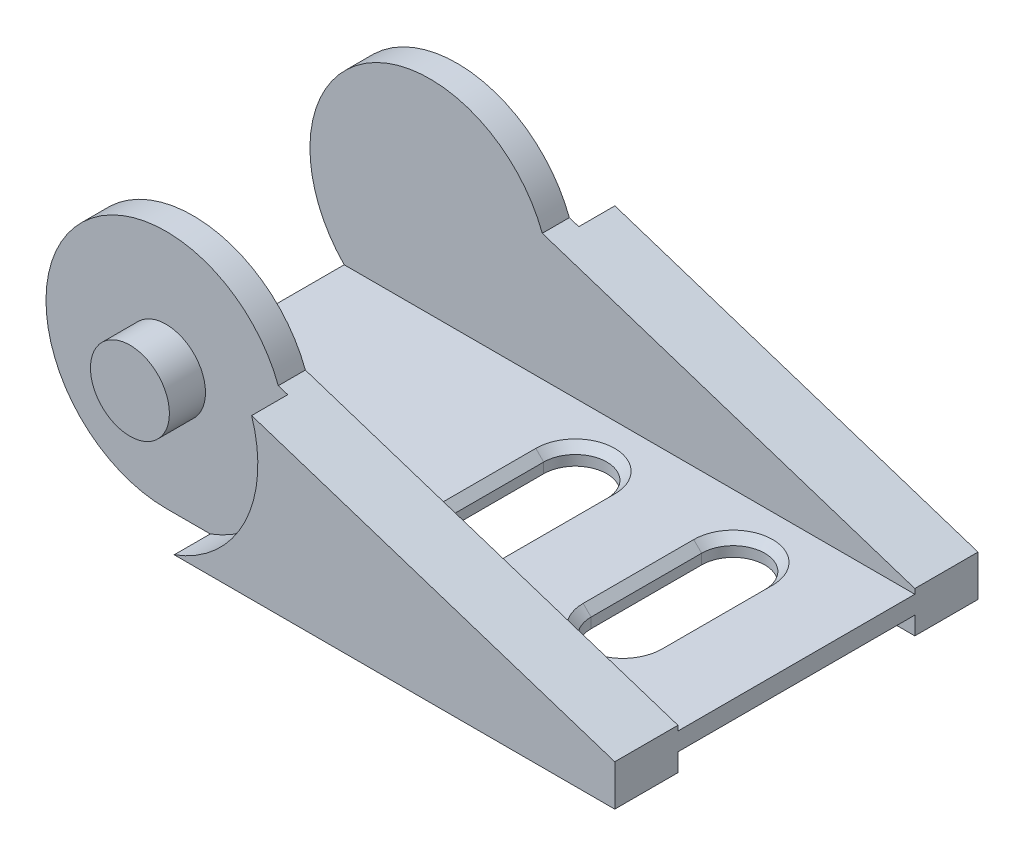
ISO-10303-21;
HEADER;
FILE_DESCRIPTION(('STEP AP214'),'2;1');
FILE_NAME('part.step','',(''),(''),'','','');
FILE_SCHEMA(('AUTOMOTIVE_DESIGN { 1 0 10303 214 1 1 1 1 }'));
ENDSEC;
DATA;
#1=APPLICATION_CONTEXT('core data for automotive mechanical design processes');
#2=APPLICATION_PROTOCOL_DEFINITION('international standard','automotive_design',2000,#1);
#3=PRODUCT_CONTEXT('',#1,'mechanical');
#4=PRODUCT('Part','Part','',(#3));
#5=PRODUCT_RELATED_PRODUCT_CATEGORY('part','',(#4));
#6=PRODUCT_DEFINITION_FORMATION('','',#4);
#7=PRODUCT_DEFINITION_CONTEXT('part definition',#1,'design');
#8=PRODUCT_DEFINITION('design','',#6,#7);
#9=PRODUCT_DEFINITION_SHAPE('','',#8);
#10=(LENGTH_UNIT() NAMED_UNIT(*) SI_UNIT(.MILLI.,.METRE.));
#11=(NAMED_UNIT(*) PLANE_ANGLE_UNIT() SI_UNIT($,.RADIAN.));
#12=(NAMED_UNIT(*) SI_UNIT($,.STERADIAN.) SOLID_ANGLE_UNIT());
#13=UNCERTAINTY_MEASURE_WITH_UNIT(LENGTH_MEASURE(1.E-05),#10,'distance_accuracy_value','');
#14=(GEOMETRIC_REPRESENTATION_CONTEXT(3) GLOBAL_UNCERTAINTY_ASSIGNED_CONTEXT((#13)) GLOBAL_UNIT_ASSIGNED_CONTEXT((#10,
#11,#12)) REPRESENTATION_CONTEXT('',''));
#15=CARTESIAN_POINT('',(0.,0.,0.));
#16=DIRECTION('',(0.,0.,1.));
#17=DIRECTION('',(1.,0.,0.));
#18=AXIS2_PLACEMENT_3D('',#15,#16,#17);
#19=CARTESIAN_POINT('',(-15.35,0.,-23.));
#20=DIRECTION('',(0.,0.,1.));
#21=DIRECTION('',(1.,0.,0.));
#22=AXIS2_PLACEMENT_3D('',#19,#20,#21);
#23=CYLINDRICAL_SURFACE('',#22,7.6);
#24=DIRECTION('',(0.,0.,1.));
#25=VECTOR('',#24,1.);
#26=CARTESIAN_POINT('',(-8.23969257201049,2.68393894853762,-23.));
#27=LINE('',#26,#25);
#28=CARTESIAN_POINT('',(-8.23969257201049,2.68393894853762,-20.7142857142857));
#29=VERTEX_POINT('',#28);
#30=CARTESIAN_POINT('',(-8.23969257201049,2.68393894853762,-19.));
#31=VERTEX_POINT('',#30);
#32=EDGE_CURVE('E267',#29,#31,#27,.T.);
#33=ORIENTED_EDGE('',*,*,#32,.F.);
#34=CARTESIAN_POINT('',(-15.35,0.,-20.7142857142857));
#35=DIRECTION('',(0.,0.,-1.));
#36=DIRECTION('',(-1.,0.,0.));
#37=AXIS2_PLACEMENT_3D('',#34,#35,#36);
#38=CIRCLE('',#37,7.6);
#39=CARTESIAN_POINT('',(-15.35,-7.6,-20.7142857142857));
#40=VERTEX_POINT('',#39);
#41=EDGE_CURVE('E424',#29,#40,#38,.F.);
#42=ORIENTED_EDGE('',*,*,#41,.T.);
#43=DIRECTION('',(0.,0.,1.));
#44=VECTOR('',#43,1.);
#45=CARTESIAN_POINT('',(-15.35,-7.6,-23.));
#46=LINE('',#45,#44);
#47=CARTESIAN_POINT('',(-15.35,-7.60000000000001,-19.));
#48=VERTEX_POINT('',#47);
#49=EDGE_CURVE('E277',#40,#48,#46,.T.);
#50=ORIENTED_EDGE('',*,*,#49,.T.);
#51=CARTESIAN_POINT('',(-15.35,0.,-19.));
#52=DIRECTION('',(0.,0.,-1.));
#53=DIRECTION('',(-1.,0.,0.));
#54=AXIS2_PLACEMENT_3D('',#51,#52,#53);
#55=CIRCLE('',#54,7.6);
#56=CARTESIAN_POINT('',(-19.3581549524,-6.45714285714288,-19.));
#57=VERTEX_POINT('',#56);
#58=EDGE_CURVE('E470',#57,#48,#55,.F.);
#59=ORIENTED_EDGE('',*,*,#58,.F.);
#60=DIRECTION('',(0.,0.,1.));
#61=VECTOR('',#60,1.);
#62=CARTESIAN_POINT('',(-19.3581549524,-6.45714285714288,-23.));
#63=LINE('',#62,#61);
#64=CARTESIAN_POINT('',(-19.3581549524,-6.45714285714288,-4.));
#65=VERTEX_POINT('',#64);
#66=EDGE_CURVE('E468',#65,#57,#63,.F.);
#67=ORIENTED_EDGE('',*,*,#66,.F.);
#68=CARTESIAN_POINT('',(-15.35,0.,-4.));
#69=DIRECTION('',(0.,0.,1.));
#70=DIRECTION('',(1.,0.,0.));
#71=AXIS2_PLACEMENT_3D('',#68,#69,#70);
#72=CIRCLE('',#71,7.6);
#73=CARTESIAN_POINT('',(-15.35,-7.60000000000001,-4.));
#74=VERTEX_POINT('',#73);
#75=EDGE_CURVE('E472',#74,#65,#72,.F.);
#76=ORIENTED_EDGE('',*,*,#75,.F.);
#77=CARTESIAN_POINT('',(-15.35,-7.6,-2.28571428571429));
#78=VERTEX_POINT('',#77);
#79=EDGE_CURVE('E270',#74,#78,#46,.T.);
#80=ORIENTED_EDGE('',*,*,#79,.T.);
#81=CARTESIAN_POINT('',(-15.35,0.,-2.28571428571429));
#82=DIRECTION('',(0.,0.,1.));
#83=DIRECTION('',(1.,0.,0.));
#84=AXIS2_PLACEMENT_3D('',#81,#82,#83);
#85=CIRCLE('',#84,7.6);
#86=CARTESIAN_POINT('',(-8.23969257201049,2.68393894853762,-2.28571428571429));
#87=VERTEX_POINT('',#86);
#88=EDGE_CURVE('E288',#78,#87,#85,.F.);
#89=ORIENTED_EDGE('',*,*,#88,.T.);
#90=CARTESIAN_POINT('',(-8.23969257201049,2.68393894853762,-4.));
#91=VERTEX_POINT('',#90);
#92=EDGE_CURVE('E254',#91,#87,#27,.T.);
#93=ORIENTED_EDGE('',*,*,#92,.F.);
#94=CARTESIAN_POINT('',(-15.35,0.,-4.));
#95=DIRECTION('',(0.,0.,1.));
#96=DIRECTION('',(0.,-1.,0.));
#97=AXIS2_PLACEMENT_3D('',#94,#95,#96);
#98=CIRCLE('',#97,7.6);
#99=CARTESIAN_POINT('',(-20.7830808338307,-5.31428571428573,-4.));
#100=VERTEX_POINT('',#99);
#101=EDGE_CURVE('E393',#100,#91,#98,.F.);
#102=ORIENTED_EDGE('',*,*,#101,.F.);
#103=DIRECTION('',(0.,0.,1.));
#104=VECTOR('',#103,1.);
#105=CARTESIAN_POINT('',(-20.7830808338307,-5.31428571428573,-23.));
#106=LINE('',#105,#104);
#107=CARTESIAN_POINT('',(-20.7830808338307,-5.31428571428573,-19.));
#108=VERTEX_POINT('',#107);
#109=EDGE_CURVE('E260',#108,#100,#106,.T.);
#110=ORIENTED_EDGE('',*,*,#109,.F.);
#111=CARTESIAN_POINT('',(-15.35,0.,-19.));
#112=DIRECTION('',(0.,0.,-1.));
#113=DIRECTION('',(0.,1.,0.));
#114=AXIS2_PLACEMENT_3D('',#111,#112,#113);
#115=CIRCLE('',#114,7.6);
#116=EDGE_CURVE('E391',#31,#108,#115,.F.);
#117=ORIENTED_EDGE('',*,*,#116,.F.);
#118=EDGE_LOOP('',(#33,#42,#50,#59,#67,#76,#80,#89,#93,#102,#110,#117));
#119=FACE_BOUND('',#118,.T.);
#120=ADVANCED_FACE('F36',(#119),#23,.T.);
#121=CARTESIAN_POINT('',(-15.35,-7.6,-23.));
#122=DIRECTION('',(0.,-1.,0.));
#123=DIRECTION('',(1.,0.,0.));
#124=AXIS2_PLACEMENT_3D('',#121,#122,#123);
#125=PLANE('',#124);
#126=DIRECTION('',(1.,0.,0.));
#127=VECTOR('',#126,1.);
#128=CARTESIAN_POINT('',(-15.35,-7.6,-20.7142857142857));
#129=LINE('',#128,#127);
#130=CARTESIAN_POINT('',(-12.5482148547756,-7.6,-20.7142857142857));
#131=VERTEX_POINT('',#130);
#132=EDGE_CURVE('E429',#40,#131,#129,.T.);
#133=ORIENTED_EDGE('',*,*,#132,.T.);
#134=DIRECTION('',(0.,0.,-1.));
#135=VECTOR('',#134,1.);
#136=CARTESIAN_POINT('',(-12.5482148547756,-7.6,-20.7142857142857));
#137=LINE('',#136,#135);
#138=CARTESIAN_POINT('',(-12.5482148547756,-7.6,-23.));
#139=VERTEX_POINT('',#138);
#140=EDGE_CURVE('E875',#131,#139,#137,.T.);
#141=ORIENTED_EDGE('',*,*,#140,.T.);
#142=DIRECTION('',(1.,0.,0.));
#143=VECTOR('',#142,1.);
#144=CARTESIAN_POINT('',(-15.35,-7.6,-23.));
#145=LINE('',#144,#143);
#146=CARTESIAN_POINT('',(15.35,-7.59999999999999,-23.));
#147=VERTEX_POINT('',#146);
#148=EDGE_CURVE('E243',#139,#147,#145,.T.);
#149=ORIENTED_EDGE('',*,*,#148,.T.);
#150=DIRECTION('',(0.,0.,1.));
#151=VECTOR('',#150,1.);
#152=CARTESIAN_POINT('',(15.35,-7.59999999999999,-23.));
#153=LINE('',#152,#151);
#154=CARTESIAN_POINT('',(15.35,-7.59999999999999,-19.));
#155=VERTEX_POINT('',#154);
#156=EDGE_CURVE('E272',#147,#155,#153,.T.);
#157=ORIENTED_EDGE('',*,*,#156,.T.);
#158=DIRECTION('',(1.,0.,0.));
#159=VECTOR('',#158,1.);
#160=CARTESIAN_POINT('',(-22.95,-7.60000000000002,-19.));
#161=LINE('',#160,#159);
#162=EDGE_CURVE('E435',#48,#155,#161,.T.);
#163=ORIENTED_EDGE('',*,*,#162,.F.);
#164=ORIENTED_EDGE('',*,*,#49,.F.);
#165=EDGE_LOOP('',(#133,#141,#149,#157,#163,#164));
#166=FACE_BOUND('',#165,.T.);
#167=ADVANCED_FACE('F434',(#166),#125,.T.);
#168=CARTESIAN_POINT('',(-8.23969257201049,2.68393894853762,-23.));
#169=DIRECTION('',(-0.309716291994659,-0.950829016423604,0.));
#170=DIRECTION('',(0.950829016423605,-0.309716291994659,0.));
#171=AXIS2_PLACEMENT_3D('',#168,#169,#170);
#172=PLANE('',#171);
#173=DIRECTION('',(0.,0.,-1.));
#174=VECTOR('',#173,1.);
#175=CARTESIAN_POINT('',(-7.6419734396417,2.48924216274974,-20.7142857142857));
#176=LINE('',#175,#174);
#177=CARTESIAN_POINT('',(-7.6419734396417,2.48924216274974,-20.7142857142857));
#178=VERTEX_POINT('',#177);
#179=CARTESIAN_POINT('',(-7.6419734396417,2.48924216274974,-23.));
#180=VERTEX_POINT('',#179);
#181=EDGE_CURVE('E224',#178,#180,#176,.T.);
#182=ORIENTED_EDGE('',*,*,#181,.F.);
#183=DIRECTION('',(0.950829016423605,-0.309716291994659,0.));
#184=VECTOR('',#183,1.);
#185=CARTESIAN_POINT('',(-8.23969257201049,2.68393894853762,-20.7142857142857));
#186=LINE('',#185,#184);
#187=EDGE_CURVE('E235',#29,#178,#186,.T.);
#188=ORIENTED_EDGE('',*,*,#187,.F.);
#189=ORIENTED_EDGE('',*,*,#32,.T.);
#190=DIRECTION('',(0.950829016423605,-0.309716291994659,0.));
#191=VECTOR('',#190,1.);
#192=CARTESIAN_POINT('',(-8.23969257201049,2.68393894853762,-19.));
#193=LINE('',#192,#191);
#194=CARTESIAN_POINT('',(15.35,-5.,-19.));
#195=VERTEX_POINT('',#194);
#196=EDGE_CURVE('E275',#31,#195,#193,.T.);
#197=ORIENTED_EDGE('',*,*,#196,.T.);
#198=DIRECTION('',(0.,0.,1.));
#199=VECTOR('',#198,1.);
#200=CARTESIAN_POINT('',(15.35,-5.,-23.));
#201=LINE('',#200,#199);
#202=CARTESIAN_POINT('',(15.35,-5.,-23.));
#203=VERTEX_POINT('',#202);
#204=EDGE_CURVE('E249',#203,#195,#201,.T.);
#205=ORIENTED_EDGE('',*,*,#204,.F.);
#206=DIRECTION('',(0.950829016423604,-0.309716291994659,0.));
#207=VECTOR('',#206,1.);
#208=CARTESIAN_POINT('',(-8.23969257201049,2.68393894853762,-23.));
#209=LINE('',#208,#207);
#210=EDGE_CURVE('E241',#180,#203,#209,.T.);
#211=ORIENTED_EDGE('',*,*,#210,.F.);
#212=EDGE_LOOP('',(#182,#188,#189,#197,#205,#211));
#213=FACE_BOUND('',#212,.T.);
#214=ADVANCED_FACE('F246',(#213),#172,.F.);
#215=DIRECTION('',(0.,0.,1.));
#216=VECTOR('',#215,1.);
#217=CARTESIAN_POINT('',(-12.5482148547756,-7.6,-2.28571428571429));
#218=LINE('',#217,#216);
#219=CARTESIAN_POINT('',(-12.5482148547756,-7.6,-2.28571428571429));
#220=VERTEX_POINT('',#219);
#221=CARTESIAN_POINT('',(-12.5482148547756,-7.6,0.));
#222=VERTEX_POINT('',#221);
#223=EDGE_CURVE('E840',#220,#222,#218,.T.);
#224=ORIENTED_EDGE('',*,*,#223,.F.);
#225=DIRECTION('',(-1.,0.,0.));
#226=VECTOR('',#225,1.);
#227=CARTESIAN_POINT('',(-15.35,-7.6,-2.28571428571429));
#228=LINE('',#227,#226);
#229=EDGE_CURVE('E842',#220,#78,#228,.T.);
#230=ORIENTED_EDGE('',*,*,#229,.T.);
#231=ORIENTED_EDGE('',*,*,#79,.F.);
#232=DIRECTION('',(1.,0.,0.));
#233=VECTOR('',#232,1.);
#234=CARTESIAN_POINT('',(-22.95,-7.60000000000002,-4.));
#235=LINE('',#234,#233);
#236=CARTESIAN_POINT('',(15.35,-7.59999999999999,-4.));
#237=VERTEX_POINT('',#236);
#238=EDGE_CURVE('E441',#74,#237,#235,.T.);
#239=ORIENTED_EDGE('',*,*,#238,.T.);
#240=CARTESIAN_POINT('',(15.35,-7.59999999999999,0.));
#241=VERTEX_POINT('',#240);
#242=EDGE_CURVE('E276',#237,#241,#153,.T.);
#243=ORIENTED_EDGE('',*,*,#242,.T.);
#244=DIRECTION('',(1.,0.,0.));
#245=VECTOR('',#244,1.);
#246=CARTESIAN_POINT('',(-15.35,-7.6,0.));
#247=LINE('',#246,#245);
#248=EDGE_CURVE('E265',#222,#241,#247,.T.);
#249=ORIENTED_EDGE('',*,*,#248,.F.);
#250=EDGE_LOOP('',(#224,#230,#231,#239,#243,#249));
#251=FACE_BOUND('',#250,.T.);
#252=ADVANCED_FACE('F533',(#251),#125,.T.);
#253=DIRECTION('',(-0.950829016423605,0.309716291994659,0.));
#254=VECTOR('',#253,1.);
#255=CARTESIAN_POINT('',(-8.23969257201049,2.68393894853762,-2.28571428571429));
#256=LINE('',#255,#254);
#257=CARTESIAN_POINT('',(-7.6419734396417,2.48924216274974,-2.28571428571429));
#258=VERTEX_POINT('',#257);
#259=EDGE_CURVE('E412',#258,#87,#256,.T.);
#260=ORIENTED_EDGE('',*,*,#259,.F.);
#261=DIRECTION('',(0.,0.,1.));
#262=VECTOR('',#261,1.);
#263=CARTESIAN_POINT('',(-7.6419734396417,2.48924216274974,-2.28571428571429));
#264=LINE('',#263,#262);
#265=CARTESIAN_POINT('',(-7.6419734396417,2.48924216274974,0.));
#266=VERTEX_POINT('',#265);
#267=EDGE_CURVE('E846',#258,#266,#264,.T.);
#268=ORIENTED_EDGE('',*,*,#267,.T.);
#269=DIRECTION('',(0.950829016423604,-0.309716291994659,0.));
#270=VECTOR('',#269,1.);
#271=CARTESIAN_POINT('',(-8.23969257201049,2.68393894853762,0.));
#272=LINE('',#271,#270);
#273=CARTESIAN_POINT('',(15.35,-5.,0.));
#274=VERTEX_POINT('',#273);
#275=EDGE_CURVE('E257',#266,#274,#272,.T.);
#276=ORIENTED_EDGE('',*,*,#275,.T.);
#277=CARTESIAN_POINT('',(15.35,-4.99999999999999,-4.));
#278=VERTEX_POINT('',#277);
#279=EDGE_CURVE('E266',#278,#274,#201,.T.);
#280=ORIENTED_EDGE('',*,*,#279,.F.);
#281=DIRECTION('',(-0.950829016423605,0.309716291994659,0.));
#282=VECTOR('',#281,1.);
#283=CARTESIAN_POINT('',(-8.23969257201049,2.68393894853762,-4.));
#284=LINE('',#283,#282);
#285=EDGE_CURVE('E280',#278,#91,#284,.T.);
#286=ORIENTED_EDGE('',*,*,#285,.T.);
#287=ORIENTED_EDGE('',*,*,#92,.T.);
#288=EDGE_LOOP('',(#260,#268,#276,#280,#286,#287));
#289=FACE_BOUND('',#288,.T.);
#290=ADVANCED_FACE('F410',(#289),#172,.F.);
#291=CARTESIAN_POINT('',(-15.35,0.,-23.));
#292=DIRECTION('',(0.,0.,1.));
#293=DIRECTION('',(1.,0.,0.));
#294=AXIS2_PLACEMENT_3D('',#291,#292,#293);
#295=PLANE('',#294);
#296=CARTESIAN_POINT('',(-15.35,0.,-23.));
#297=DIRECTION('',(0.,0.,1.));
#298=DIRECTION('',(1.,0.,0.));
#299=AXIS2_PLACEMENT_3D('',#296,#297,#298);
#300=CIRCLE('',#299,8.1);
#301=EDGE_CURVE('E227',#139,#180,#300,.T.);
#302=ORIENTED_EDGE('',*,*,#301,.T.);
#303=ORIENTED_EDGE('',*,*,#210,.T.);
#304=DIRECTION('',(0.,-1.,0.));
#305=VECTOR('',#304,1.);
#306=CARTESIAN_POINT('',(15.35,-5.,-23.));
#307=LINE('',#306,#305);
#308=EDGE_CURVE('E251',#203,#147,#307,.T.);
#309=ORIENTED_EDGE('',*,*,#308,.T.);
#310=ORIENTED_EDGE('',*,*,#148,.F.);
#311=EDGE_LOOP('',(#302,#303,#309,#310));
#312=FACE_BOUND('',#311,.T.);
#313=ADVANCED_FACE('F239',(#312),#295,.F.);
#314=CARTESIAN_POINT('',(-15.35,0.,0.));
#315=DIRECTION('',(0.,0.,1.));
#316=DIRECTION('',(1.,0.,0.));
#317=AXIS2_PLACEMENT_3D('',#314,#315,#316);
#318=PLANE('',#317);
#319=CARTESIAN_POINT('',(-15.35,0.,0.));
#320=DIRECTION('',(0.,0.,1.));
#321=DIRECTION('',(1.,0.,0.));
#322=AXIS2_PLACEMENT_3D('',#319,#320,#321);
#323=CIRCLE('',#322,8.1);
#324=EDGE_CURVE('E286',#222,#266,#323,.T.);
#325=ORIENTED_EDGE('',*,*,#324,.F.);
#326=ORIENTED_EDGE('',*,*,#248,.T.);
#327=DIRECTION('',(0.,-1.,0.));
#328=VECTOR('',#327,1.);
#329=CARTESIAN_POINT('',(15.35,-5.,0.));
#330=LINE('',#329,#328);
#331=EDGE_CURVE('E252',#274,#241,#330,.T.);
#332=ORIENTED_EDGE('',*,*,#331,.F.);
#333=ORIENTED_EDGE('',*,*,#275,.F.);
#334=EDGE_LOOP('',(#325,#326,#332,#333));
#335=FACE_BOUND('',#334,.T.);
#336=ADVANCED_FACE('F736',(#335),#318,.T.);
#337=CARTESIAN_POINT('',(15.35,-5.,-23.));
#338=DIRECTION('',(-1.,0.,0.));
#339=DIRECTION('',(0.,-1.,0.));
#340=AXIS2_PLACEMENT_3D('',#337,#338,#339);
#341=PLANE('',#340);
#342=ORIENTED_EDGE('',*,*,#242,.F.);
#343=DIRECTION('',(0.,-1.,0.));
#344=VECTOR('',#343,1.);
#345=CARTESIAN_POINT('',(15.35,-6.45714285714285,-4.));
#346=LINE('',#345,#344);
#347=CARTESIAN_POINT('',(15.35,-6.45714285714285,-4.));
#348=VERTEX_POINT('',#347);
#349=EDGE_CURVE('E854',#348,#237,#346,.T.);
#350=ORIENTED_EDGE('',*,*,#349,.F.);
#351=DIRECTION('',(0.,0.,1.));
#352=VECTOR('',#351,1.);
#353=CARTESIAN_POINT('',(15.35,-6.45714285714285,-4.));
#354=LINE('',#353,#352);
#355=CARTESIAN_POINT('',(15.35,-6.45714285714285,-19.));
#356=VERTEX_POINT('',#355);
#357=EDGE_CURVE('E446',#356,#348,#354,.T.);
#358=ORIENTED_EDGE('',*,*,#357,.F.);
#359=DIRECTION('',(0.,1.,0.));
#360=VECTOR('',#359,1.);
#361=CARTESIAN_POINT('',(15.35,-6.45714285714285,-19.));
#362=LINE('',#361,#360);
#363=EDGE_CURVE('E856',#155,#356,#362,.T.);
#364=ORIENTED_EDGE('',*,*,#363,.F.);
#365=ORIENTED_EDGE('',*,*,#156,.F.);
#366=ORIENTED_EDGE('',*,*,#308,.F.);
#367=ORIENTED_EDGE('',*,*,#204,.T.);
#368=DIRECTION('',(0.,1.,0.));
#369=VECTOR('',#368,1.);
#370=CARTESIAN_POINT('',(15.35,7.60000000000002,-19.));
#371=LINE('',#370,#369);
#372=CARTESIAN_POINT('',(15.35,-5.3142857142857,-19.));
#373=VERTEX_POINT('',#372);
#374=EDGE_CURVE('E386',#373,#195,#371,.T.);
#375=ORIENTED_EDGE('',*,*,#374,.F.);
#376=DIRECTION('',(0.,0.,-1.));
#377=VECTOR('',#376,1.);
#378=CARTESIAN_POINT('',(15.35,-5.31428571428571,-4.));
#379=LINE('',#378,#377);
#380=CARTESIAN_POINT('',(15.35,-5.31428571428571,-4.));
#381=VERTEX_POINT('',#380);
#382=EDGE_CURVE('E383',#381,#373,#379,.T.);
#383=ORIENTED_EDGE('',*,*,#382,.F.);
#384=DIRECTION('',(0.,-1.,0.));
#385=VECTOR('',#384,1.);
#386=CARTESIAN_POINT('',(15.35,7.60000000000002,-4.));
#387=LINE('',#386,#385);
#388=EDGE_CURVE('E373',#278,#381,#387,.T.);
#389=ORIENTED_EDGE('',*,*,#388,.F.);
#390=ORIENTED_EDGE('',*,*,#279,.T.);
#391=ORIENTED_EDGE('',*,*,#331,.T.);
#392=EDGE_LOOP('',(#342,#350,#358,#364,#365,#366,#367,#375,#383,#389,#390,#391));
#393=FACE_BOUND('',#392,.T.);
#394=ADVANCED_FACE('F417',(#393),#341,.F.);
#395=CARTESIAN_POINT('',(-22.95,7.59999999999999,-4.));
#396=DIRECTION('',(0.,0.,1.));
#397=DIRECTION('',(0.,-1.,0.));
#398=AXIS2_PLACEMENT_3D('',#395,#396,#397);
#399=PLANE('',#398);
#400=ORIENTED_EDGE('',*,*,#101,.T.);
#401=ORIENTED_EDGE('',*,*,#285,.F.);
#402=ORIENTED_EDGE('',*,*,#388,.T.);
#403=DIRECTION('',(1.,0.,0.));
#404=VECTOR('',#403,1.);
#405=CARTESIAN_POINT('',(-22.95,-5.31428571428573,-4.));
#406=LINE('',#405,#404);
#407=EDGE_CURVE('E388',#100,#381,#406,.T.);
#408=ORIENTED_EDGE('',*,*,#407,.F.);
#409=EDGE_LOOP('',(#400,#401,#402,#408));
#410=FACE_BOUND('',#409,.T.);
#411=ADVANCED_FACE('F401',(#410),#399,.F.);
#412=CARTESIAN_POINT('',(-22.95,7.59999999999999,-19.));
#413=DIRECTION('',(0.,0.,-1.));
#414=DIRECTION('',(0.,1.,0.));
#415=AXIS2_PLACEMENT_3D('',#412,#413,#414);
#416=PLANE('',#415);
#417=ORIENTED_EDGE('',*,*,#116,.T.);
#418=DIRECTION('',(1.,0.,0.));
#419=VECTOR('',#418,1.);
#420=CARTESIAN_POINT('',(-22.95,-5.31428571428573,-19.));
#421=LINE('',#420,#419);
#422=EDGE_CURVE('E389',#108,#373,#421,.T.);
#423=ORIENTED_EDGE('',*,*,#422,.T.);
#424=ORIENTED_EDGE('',*,*,#374,.T.);
#425=ORIENTED_EDGE('',*,*,#196,.F.);
#426=EDGE_LOOP('',(#417,#423,#424,#425));
#427=FACE_BOUND('',#426,.T.);
#428=ADVANCED_FACE('F422',(#427),#416,.F.);
#429=CARTESIAN_POINT('',(-22.95,-5.31428571428573,-4.));
#430=DIRECTION('',(0.,-1.,0.));
#431=DIRECTION('',(1.,0.,0.));
#432=AXIS2_PLACEMENT_3D('',#429,#430,#431);
#433=PLANE('',#432);
#434=DIRECTION('',(0.,0.,1.));
#435=VECTOR('',#434,1.);
#436=CARTESIAN_POINT('',(0.350000000000007,-5.31428571428572,-4.));
#437=LINE('',#436,#435);
#438=CARTESIAN_POINT('',(0.350000000000006,-5.31428571428571,-15.));
#439=VERTEX_POINT('',#438);
#440=CARTESIAN_POINT('',(0.350000000000006,-5.31428571428572,-8.));
#441=VERTEX_POINT('',#440);
#442=EDGE_CURVE('E307',#439,#441,#437,.T.);
#443=ORIENTED_EDGE('',*,*,#442,.T.);
#444=CARTESIAN_POINT('',(-2.15,-5.31428571428572,-8.));
#445=DIRECTION('',(0.,-1.,0.));
#446=DIRECTION('',(1.,0.,0.));
#447=AXIS2_PLACEMENT_3D('',#444,#445,#446);
#448=CIRCLE('',#447,2.50000000000001);
#449=CARTESIAN_POINT('',(-4.65000000000001,-5.31428571428572,-8.));
#450=VERTEX_POINT('',#449);
#451=EDGE_CURVE('E309',#441,#450,#448,.T.);
#452=ORIENTED_EDGE('',*,*,#451,.T.);
#453=DIRECTION('',(0.,0.,-1.));
#454=VECTOR('',#453,1.);
#455=CARTESIAN_POINT('',(-4.65000000000001,-5.31428571428572,-4.));
#456=LINE('',#455,#454);
#457=CARTESIAN_POINT('',(-4.65000000000001,-5.31428571428572,-15.));
#458=VERTEX_POINT('',#457);
#459=EDGE_CURVE('E305',#450,#458,#456,.T.);
#460=ORIENTED_EDGE('',*,*,#459,.T.);
#461=CARTESIAN_POINT('',(-2.15,-5.31428571428572,-15.));
#462=DIRECTION('',(0.,-1.,0.));
#463=DIRECTION('',(1.,0.,0.));
#464=AXIS2_PLACEMENT_3D('',#461,#462,#463);
#465=CIRCLE('',#464,2.50000000000001);
#466=EDGE_CURVE('E303',#458,#439,#465,.T.);
#467=ORIENTED_EDGE('',*,*,#466,.T.);
#468=EDGE_LOOP('',(#443,#452,#460,#467));
#469=FACE_BOUND('',#468,.T.);
#470=DIRECTION('',(0.,0.,1.));
#471=VECTOR('',#470,1.);
#472=CARTESIAN_POINT('',(10.35,-5.31428571428571,-4.));
#473=LINE('',#472,#471);
#474=CARTESIAN_POINT('',(10.35,-5.31428571428571,-15.));
#475=VERTEX_POINT('',#474);
#476=CARTESIAN_POINT('',(10.35,-5.31428571428571,-8.));
#477=VERTEX_POINT('',#476);
#478=EDGE_CURVE('E298',#475,#477,#473,.T.);
#479=ORIENTED_EDGE('',*,*,#478,.T.);
#480=CARTESIAN_POINT('',(7.85,-5.31428571428571,-8.));
#481=DIRECTION('',(0.,-1.,0.));
#482=DIRECTION('',(1.,0.,0.));
#483=AXIS2_PLACEMENT_3D('',#480,#481,#482);
#484=CIRCLE('',#483,2.49999999999999);
#485=CARTESIAN_POINT('',(5.35,-5.31428571428571,-8.));
#486=VERTEX_POINT('',#485);
#487=EDGE_CURVE('E300',#477,#486,#484,.T.);
#488=ORIENTED_EDGE('',*,*,#487,.T.);
#489=DIRECTION('',(0.,0.,-1.));
#490=VECTOR('',#489,1.);
#491=CARTESIAN_POINT('',(5.35,-5.31428571428571,-4.));
#492=LINE('',#491,#490);
#493=CARTESIAN_POINT('',(5.35,-5.31428571428571,-15.));
#494=VERTEX_POINT('',#493);
#495=EDGE_CURVE('E294',#486,#494,#492,.T.);
#496=ORIENTED_EDGE('',*,*,#495,.T.);
#497=CARTESIAN_POINT('',(7.85,-5.31428571428571,-15.));
#498=DIRECTION('',(0.,-1.,0.));
#499=DIRECTION('',(1.,0.,0.));
#500=AXIS2_PLACEMENT_3D('',#497,#498,#499);
#501=CIRCLE('',#500,2.5);
#502=EDGE_CURVE('E296',#494,#475,#501,.T.);
#503=ORIENTED_EDGE('',*,*,#502,.T.);
#504=EDGE_LOOP('',(#479,#488,#496,#503));
#505=FACE_BOUND('',#504,.T.);
#506=ORIENTED_EDGE('',*,*,#109,.T.);
#507=ORIENTED_EDGE('',*,*,#407,.T.);
#508=ORIENTED_EDGE('',*,*,#382,.T.);
#509=ORIENTED_EDGE('',*,*,#422,.F.);
#510=EDGE_LOOP('',(#506,#507,#508,#509));
#511=FACE_BOUND('',#510,.T.);
#512=ADVANCED_FACE('F352',(#469,#505,#511),#433,.F.);
#513=CARTESIAN_POINT('',(7.85,-7.6,-15.));
#514=DIRECTION('',(0.,1.,0.));
#515=DIRECTION('',(-1.,0.,0.));
#516=AXIS2_PLACEMENT_3D('',#513,#514,#515);
#517=CYLINDRICAL_SURFACE('',#516,2.);
#518=DIRECTION('',(0.,1.,0.));
#519=VECTOR('',#518,1.);
#520=CARTESIAN_POINT('',(9.85,-7.6,-15.));
#521=LINE('',#520,#519);
#522=CARTESIAN_POINT('',(9.85,-6.45714285714285,-15.));
#523=VERTEX_POINT('',#522);
#524=CARTESIAN_POINT('',(9.85,-5.8142857142857,-15.));
#525=VERTEX_POINT('',#524);
#526=EDGE_CURVE('E371',#523,#525,#521,.T.);
#527=ORIENTED_EDGE('',*,*,#526,.T.);
#528=CARTESIAN_POINT('',(7.85,-5.8142857142857,-15.));
#529=DIRECTION('',(0.,-1.,0.));
#530=DIRECTION('',(0.,0.,-1.));
#531=AXIS2_PLACEMENT_3D('',#528,#529,#530);
#532=CIRCLE('',#531,2.);
#533=CARTESIAN_POINT('',(5.85,-5.81428571428571,-15.));
#534=VERTEX_POINT('',#533);
#535=EDGE_CURVE('E45',#525,#534,#532,.F.);
#536=ORIENTED_EDGE('',*,*,#535,.T.);
#537=DIRECTION('',(0.,1.,0.));
#538=VECTOR('',#537,1.);
#539=CARTESIAN_POINT('',(5.85,-7.60000000000001,-15.));
#540=LINE('',#539,#538);
#541=CARTESIAN_POINT('',(5.85,-6.45714285714286,-15.));
#542=VERTEX_POINT('',#541);
#543=EDGE_CURVE('E375',#542,#534,#540,.T.);
#544=ORIENTED_EDGE('',*,*,#543,.F.);
#545=CARTESIAN_POINT('',(7.85,-6.45714285714286,-15.));
#546=DIRECTION('',(0.,1.,0.));
#547=DIRECTION('',(-1.,0.,0.));
#548=AXIS2_PLACEMENT_3D('',#545,#546,#547);
#549=CIRCLE('',#548,2.);
#550=EDGE_CURVE('E465',#542,#523,#549,.F.);
#551=ORIENTED_EDGE('',*,*,#550,.T.);
#552=EDGE_LOOP('',(#527,#536,#544,#551));
#553=FACE_BOUND('',#552,.T.);
#554=ADVANCED_FACE('F702',(#553),#517,.F.);
#555=CARTESIAN_POINT('',(9.85,-7.6,-15.));
#556=DIRECTION('',(1.,0.,0.));
#557=DIRECTION('',(0.,1.,0.));
#558=AXIS2_PLACEMENT_3D('',#555,#556,#557);
#559=PLANE('',#558);
#560=DIRECTION('',(0.,1.,0.));
#561=VECTOR('',#560,1.);
#562=CARTESIAN_POINT('',(9.85,-7.6,-8.));
#563=LINE('',#562,#561);
#564=CARTESIAN_POINT('',(9.85,-6.45714285714285,-8.));
#565=VERTEX_POINT('',#564);
#566=CARTESIAN_POINT('',(9.85,-5.8142857142857,-8.));
#567=VERTEX_POINT('',#566);
#568=EDGE_CURVE('E365',#565,#567,#563,.T.);
#569=ORIENTED_EDGE('',*,*,#568,.T.);
#570=DIRECTION('',(0.,0.,-1.));
#571=VECTOR('',#570,1.);
#572=CARTESIAN_POINT('',(9.85,-5.8142857142857,-15.));
#573=LINE('',#572,#571);
#574=EDGE_CURVE('E60',#567,#525,#573,.T.);
#575=ORIENTED_EDGE('',*,*,#574,.T.);
#576=ORIENTED_EDGE('',*,*,#526,.F.);
#577=DIRECTION('',(0.,0.,1.));
#578=VECTOR('',#577,1.);
#579=CARTESIAN_POINT('',(9.85,-6.45714285714285,-15.));
#580=LINE('',#579,#578);
#581=EDGE_CURVE('E370',#523,#565,#580,.T.);
#582=ORIENTED_EDGE('',*,*,#581,.T.);
#583=EDGE_LOOP('',(#569,#575,#576,#582));
#584=FACE_BOUND('',#583,.T.);
#585=ADVANCED_FACE('F369',(#584),#559,.F.);
#586=CARTESIAN_POINT('',(7.85,-7.6,-8.));
#587=DIRECTION('',(0.,1.,0.));
#588=DIRECTION('',(-1.,0.,0.));
#589=AXIS2_PLACEMENT_3D('',#586,#587,#588);
#590=CYLINDRICAL_SURFACE('',#589,2.);
#591=DIRECTION('',(0.,1.,0.));
#592=VECTOR('',#591,1.);
#593=CARTESIAN_POINT('',(5.85,-7.60000000000001,-8.));
#594=LINE('',#593,#592);
#595=CARTESIAN_POINT('',(5.85,-6.45714285714286,-8.));
#596=VERTEX_POINT('',#595);
#597=CARTESIAN_POINT('',(5.85,-5.81428571428571,-8.));
#598=VERTEX_POINT('',#597);
#599=EDGE_CURVE('E367',#596,#598,#594,.T.);
#600=ORIENTED_EDGE('',*,*,#599,.T.);
#601=CARTESIAN_POINT('',(7.85,-5.8142857142857,-8.));
#602=DIRECTION('',(0.,-1.,0.));
#603=DIRECTION('',(0.,0.,-1.));
#604=AXIS2_PLACEMENT_3D('',#601,#602,#603);
#605=CIRCLE('',#604,2.);
#606=EDGE_CURVE('E318',#598,#567,#605,.F.);
#607=ORIENTED_EDGE('',*,*,#606,.T.);
#608=ORIENTED_EDGE('',*,*,#568,.F.);
#609=CARTESIAN_POINT('',(7.85,-6.45714285714286,-8.));
#610=DIRECTION('',(0.,1.,0.));
#611=DIRECTION('',(-1.,0.,0.));
#612=AXIS2_PLACEMENT_3D('',#609,#610,#611);
#613=CIRCLE('',#612,2.);
#614=EDGE_CURVE('E462',#565,#596,#613,.F.);
#615=ORIENTED_EDGE('',*,*,#614,.T.);
#616=EDGE_LOOP('',(#600,#607,#608,#615));
#617=FACE_BOUND('',#616,.T.);
#618=ADVANCED_FACE('F363',(#617),#590,.F.);
#619=CARTESIAN_POINT('',(5.85,-7.60000000000001,-15.));
#620=DIRECTION('',(-1.,0.,0.));
#621=DIRECTION('',(0.,-1.,0.));
#622=AXIS2_PLACEMENT_3D('',#619,#620,#621);
#623=PLANE('',#622);
#624=ORIENTED_EDGE('',*,*,#543,.T.);
#625=DIRECTION('',(0.,0.,1.));
#626=VECTOR('',#625,1.);
#627=CARTESIAN_POINT('',(5.85,-5.81428571428571,-15.));
#628=LINE('',#627,#626);
#629=EDGE_CURVE('E11',#534,#598,#628,.T.);
#630=ORIENTED_EDGE('',*,*,#629,.T.);
#631=ORIENTED_EDGE('',*,*,#599,.F.);
#632=DIRECTION('',(0.,0.,-1.));
#633=VECTOR('',#632,1.);
#634=CARTESIAN_POINT('',(5.85,-6.45714285714286,-15.));
#635=LINE('',#634,#633);
#636=EDGE_CURVE('E459',#596,#542,#635,.T.);
#637=ORIENTED_EDGE('',*,*,#636,.T.);
#638=EDGE_LOOP('',(#624,#630,#631,#637));
#639=FACE_BOUND('',#638,.T.);
#640=ADVANCED_FACE('F516',(#639),#623,.F.);
#641=CARTESIAN_POINT('',(-2.15,-7.60000000000001,-15.));
#642=DIRECTION('',(0.,1.,0.));
#643=DIRECTION('',(-1.,0.,0.));
#644=AXIS2_PLACEMENT_3D('',#641,#642,#643);
#645=CYLINDRICAL_SURFACE('',#644,2.);
#646=DIRECTION('',(0.,1.,0.));
#647=VECTOR('',#646,1.);
#648=CARTESIAN_POINT('',(-0.150000000000001,-7.60000000000001,-15.));
#649=LINE('',#648,#647);
#650=CARTESIAN_POINT('',(-0.150000000000002,-6.45714285714286,-15.));
#651=VERTEX_POINT('',#650);
#652=CARTESIAN_POINT('',(-0.150000000000002,-5.81428571428572,-15.));
#653=VERTEX_POINT('',#652);
#654=EDGE_CURVE('E380',#651,#653,#649,.T.);
#655=ORIENTED_EDGE('',*,*,#654,.T.);
#656=CARTESIAN_POINT('',(-2.15,-5.81428571428572,-15.));
#657=DIRECTION('',(0.,-1.,0.));
#658=DIRECTION('',(1.,0.,0.));
#659=AXIS2_PLACEMENT_3D('',#656,#657,#658);
#660=CIRCLE('',#659,2.);
#661=CARTESIAN_POINT('',(-4.15,-5.81428571428573,-15.));
#662=VERTEX_POINT('',#661);
#663=EDGE_CURVE('E316',#653,#662,#660,.F.);
#664=ORIENTED_EDGE('',*,*,#663,.T.);
#665=DIRECTION('',(0.,1.,0.));
#666=VECTOR('',#665,1.);
#667=CARTESIAN_POINT('',(-4.15,-7.60000000000001,-15.));
#668=LINE('',#667,#666);
#669=CARTESIAN_POINT('',(-4.15,-6.45714285714286,-15.));
#670=VERTEX_POINT('',#669);
#671=EDGE_CURVE('E474',#670,#662,#668,.T.);
#672=ORIENTED_EDGE('',*,*,#671,.F.);
#673=CARTESIAN_POINT('',(-2.15,-6.45714285714286,-15.));
#674=DIRECTION('',(0.,1.,0.));
#675=DIRECTION('',(-1.,0.,0.));
#676=AXIS2_PLACEMENT_3D('',#673,#674,#675);
#677=CIRCLE('',#676,2.);
#678=EDGE_CURVE('E456',#670,#651,#677,.F.);
#679=ORIENTED_EDGE('',*,*,#678,.T.);
#680=EDGE_LOOP('',(#655,#664,#672,#679));
#681=FACE_BOUND('',#680,.T.);
#682=ADVANCED_FACE('F514',(#681),#645,.F.);
#683=CARTESIAN_POINT('',(-0.150000000000001,-7.60000000000001,-15.));
#684=DIRECTION('',(1.,0.,0.));
#685=DIRECTION('',(0.,1.,0.));
#686=AXIS2_PLACEMENT_3D('',#683,#684,#685);
#687=PLANE('',#686);
#688=DIRECTION('',(0.,1.,0.));
#689=VECTOR('',#688,1.);
#690=CARTESIAN_POINT('',(-0.150000000000001,-7.60000000000001,-8.));
#691=LINE('',#690,#689);
#692=CARTESIAN_POINT('',(-0.15,-6.45714285714286,-8.));
#693=VERTEX_POINT('',#692);
#694=CARTESIAN_POINT('',(-0.150000000000002,-5.81428571428572,-8.));
#695=VERTEX_POINT('',#694);
#696=EDGE_CURVE('E477',#693,#695,#691,.T.);
#697=ORIENTED_EDGE('',*,*,#696,.T.);
#698=DIRECTION('',(0.,0.,-1.));
#699=VECTOR('',#698,1.);
#700=CARTESIAN_POINT('',(-0.150000000000002,-5.81428571428572,-15.));
#701=LINE('',#700,#699);
#702=EDGE_CURVE('E312',#695,#653,#701,.T.);
#703=ORIENTED_EDGE('',*,*,#702,.T.);
#704=ORIENTED_EDGE('',*,*,#654,.F.);
#705=DIRECTION('',(0.,0.,1.));
#706=VECTOR('',#705,1.);
#707=CARTESIAN_POINT('',(-0.150000000000002,-6.45714285714286,-15.));
#708=LINE('',#707,#706);
#709=EDGE_CURVE('E453',#651,#693,#708,.T.);
#710=ORIENTED_EDGE('',*,*,#709,.T.);
#711=EDGE_LOOP('',(#697,#703,#704,#710));
#712=FACE_BOUND('',#711,.T.);
#713=ADVANCED_FACE('F509',(#712),#687,.F.);
#714=CARTESIAN_POINT('',(-2.15,-7.60000000000001,-8.));
#715=DIRECTION('',(0.,1.,0.));
#716=DIRECTION('',(-1.,0.,0.));
#717=AXIS2_PLACEMENT_3D('',#714,#715,#716);
#718=CYLINDRICAL_SURFACE('',#717,2.);
#719=DIRECTION('',(0.,1.,0.));
#720=VECTOR('',#719,1.);
#721=CARTESIAN_POINT('',(-4.15,-7.60000000000001,-8.));
#722=LINE('',#721,#720);
#723=CARTESIAN_POINT('',(-4.15,-6.45714285714286,-8.));
#724=VERTEX_POINT('',#723);
#725=CARTESIAN_POINT('',(-4.15,-5.81428571428573,-8.));
#726=VERTEX_POINT('',#725);
#727=EDGE_CURVE('E480',#724,#726,#722,.T.);
#728=ORIENTED_EDGE('',*,*,#727,.T.);
#729=CARTESIAN_POINT('',(-2.15,-5.81428571428573,-8.));
#730=DIRECTION('',(0.,-1.,0.));
#731=DIRECTION('',(1.,0.,0.));
#732=AXIS2_PLACEMENT_3D('',#729,#730,#731);
#733=CIRCLE('',#732,2.);
#734=EDGE_CURVE('E234',#726,#695,#733,.F.);
#735=ORIENTED_EDGE('',*,*,#734,.T.);
#736=ORIENTED_EDGE('',*,*,#696,.F.);
#737=CARTESIAN_POINT('',(-2.15,-6.45714285714286,-8.));
#738=DIRECTION('',(0.,1.,0.));
#739=DIRECTION('',(-1.,0.,0.));
#740=AXIS2_PLACEMENT_3D('',#737,#738,#739);
#741=CIRCLE('',#740,2.);
#742=EDGE_CURVE('E450',#693,#724,#741,.F.);
#743=ORIENTED_EDGE('',*,*,#742,.T.);
#744=EDGE_LOOP('',(#728,#735,#736,#743));
#745=FACE_BOUND('',#744,.T.);
#746=ADVANCED_FACE('F507',(#745),#718,.F.);
#747=CARTESIAN_POINT('',(-4.15,-7.60000000000001,-15.));
#748=DIRECTION('',(-1.,0.,0.));
#749=DIRECTION('',(0.,-1.,0.));
#750=AXIS2_PLACEMENT_3D('',#747,#748,#749);
#751=PLANE('',#750);
#752=ORIENTED_EDGE('',*,*,#671,.T.);
#753=DIRECTION('',(0.,0.,1.));
#754=VECTOR('',#753,1.);
#755=CARTESIAN_POINT('',(-4.15,-5.81428571428573,-15.));
#756=LINE('',#755,#754);
#757=EDGE_CURVE('E314',#662,#726,#756,.T.);
#758=ORIENTED_EDGE('',*,*,#757,.T.);
#759=ORIENTED_EDGE('',*,*,#727,.F.);
#760=DIRECTION('',(0.,0.,-1.));
#761=VECTOR('',#760,1.);
#762=CARTESIAN_POINT('',(-4.15,-6.45714285714286,-15.));
#763=LINE('',#762,#761);
#764=EDGE_CURVE('E283',#724,#670,#763,.T.);
#765=ORIENTED_EDGE('',*,*,#764,.T.);
#766=EDGE_LOOP('',(#752,#758,#759,#765));
#767=FACE_BOUND('',#766,.T.);
#768=ADVANCED_FACE('F486',(#767),#751,.F.);
#769=CARTESIAN_POINT('',(-22.95,-6.45714285714288,-4.));
#770=DIRECTION('',(0.,1.,0.));
#771=DIRECTION('',(-1.,0.,0.));
#772=AXIS2_PLACEMENT_3D('',#769,#770,#771);
#773=PLANE('',#772);
#774=ORIENTED_EDGE('',*,*,#66,.T.);
#775=DIRECTION('',(1.,0.,0.));
#776=VECTOR('',#775,1.);
#777=CARTESIAN_POINT('',(-22.95,-6.45714285714288,-19.));
#778=LINE('',#777,#776);
#779=EDGE_CURVE('E440',#57,#356,#778,.T.);
#780=ORIENTED_EDGE('',*,*,#779,.T.);
#781=ORIENTED_EDGE('',*,*,#357,.T.);
#782=DIRECTION('',(1.,0.,0.));
#783=VECTOR('',#782,1.);
#784=CARTESIAN_POINT('',(-22.95,-6.45714285714288,-4.));
#785=LINE('',#784,#783);
#786=EDGE_CURVE('E443',#65,#348,#785,.T.);
#787=ORIENTED_EDGE('',*,*,#786,.F.);
#788=EDGE_LOOP('',(#774,#780,#781,#787));
#789=FACE_BOUND('',#788,.T.);
#790=ORIENTED_EDGE('',*,*,#764,.F.);
#791=ORIENTED_EDGE('',*,*,#742,.F.);
#792=ORIENTED_EDGE('',*,*,#709,.F.);
#793=ORIENTED_EDGE('',*,*,#678,.F.);
#794=EDGE_LOOP('',(#790,#791,#792,#793));
#795=FACE_BOUND('',#794,.T.);
#796=ORIENTED_EDGE('',*,*,#636,.F.);
#797=ORIENTED_EDGE('',*,*,#614,.F.);
#798=ORIENTED_EDGE('',*,*,#581,.F.);
#799=ORIENTED_EDGE('',*,*,#550,.F.);
#800=EDGE_LOOP('',(#796,#797,#798,#799));
#801=FACE_BOUND('',#800,.T.);
#802=ADVANCED_FACE('F512',(#789,#795,#801),#773,.F.);
#803=CARTESIAN_POINT('',(-22.95,-6.45714285714288,-4.));
#804=DIRECTION('',(0.,0.,1.));
#805=DIRECTION('',(1.,0.,0.));
#806=AXIS2_PLACEMENT_3D('',#803,#804,#805);
#807=PLANE('',#806);
#808=ORIENTED_EDGE('',*,*,#75,.T.);
#809=ORIENTED_EDGE('',*,*,#786,.T.);
#810=ORIENTED_EDGE('',*,*,#349,.T.);
#811=ORIENTED_EDGE('',*,*,#238,.F.);
#812=EDGE_LOOP('',(#808,#809,#810,#811));
#813=FACE_BOUND('',#812,.T.);
#814=ADVANCED_FACE('F644',(#813),#807,.F.);
#815=CARTESIAN_POINT('',(-22.95,-6.45714285714288,-19.));
#816=DIRECTION('',(0.,0.,-1.));
#817=DIRECTION('',(-1.,0.,0.));
#818=AXIS2_PLACEMENT_3D('',#815,#816,#817);
#819=PLANE('',#818);
#820=ORIENTED_EDGE('',*,*,#58,.T.);
#821=ORIENTED_EDGE('',*,*,#162,.T.);
#822=ORIENTED_EDGE('',*,*,#363,.T.);
#823=ORIENTED_EDGE('',*,*,#779,.F.);
#824=EDGE_LOOP('',(#820,#821,#822,#823));
#825=FACE_BOUND('',#824,.T.);
#826=ADVANCED_FACE('F635',(#825),#819,.F.);
#827=CARTESIAN_POINT('',(-15.35,0.,-2.28571428571429));
#828=DIRECTION('',(0.,0.,1.));
#829=DIRECTION('',(1.,0.,0.));
#830=AXIS2_PLACEMENT_3D('',#827,#828,#829);
#831=CYLINDRICAL_SURFACE('',#830,8.1);
#832=ORIENTED_EDGE('',*,*,#223,.T.);
#833=ORIENTED_EDGE('',*,*,#324,.T.);
#834=ORIENTED_EDGE('',*,*,#267,.F.);
#835=CARTESIAN_POINT('',(-15.35,0.,-2.28571428571429));
#836=DIRECTION('',(0.,0.,1.));
#837=DIRECTION('',(1.,0.,0.));
#838=AXIS2_PLACEMENT_3D('',#835,#836,#837);
#839=CIRCLE('',#838,8.1);
#840=EDGE_CURVE('E849',#220,#258,#839,.T.);
#841=ORIENTED_EDGE('',*,*,#840,.F.);
#842=EDGE_LOOP('',(#832,#833,#834,#841));
#843=FACE_BOUND('',#842,.T.);
#844=ADVANCED_FACE('F627',(#843),#831,.F.);
#845=CARTESIAN_POINT('',(-15.35,0.,-2.28571428571429));
#846=DIRECTION('',(0.,0.,1.));
#847=DIRECTION('',(1.,0.,0.));
#848=AXIS2_PLACEMENT_3D('',#845,#846,#847);
#849=PLANE('',#848);
#850=CARTESIAN_POINT('',(-15.35,0.,-2.28571428571429));
#851=DIRECTION('',(0.,0.,1.));
#852=DIRECTION('',(1.,0.,0.));
#853=AXIS2_PLACEMENT_3D('',#850,#851,#852);
#854=CIRCLE('',#853,2.5);
#855=CARTESIAN_POINT('',(-12.85,0.,-2.28571428571429));
#856=VERTEX_POINT('',#855);
#857=EDGE_CURVE('E870',#856,#856,#854,.T.);
#858=ORIENTED_EDGE('',*,*,#857,.F.);
#859=EDGE_LOOP('',(#858));
#860=FACE_BOUND('',#859,.T.);
#861=ORIENTED_EDGE('',*,*,#840,.T.);
#862=ORIENTED_EDGE('',*,*,#259,.T.);
#863=ORIENTED_EDGE('',*,*,#88,.F.);
#864=ORIENTED_EDGE('',*,*,#229,.F.);
#865=EDGE_LOOP('',(#861,#862,#863,#864));
#866=FACE_BOUND('',#865,.T.);
#867=ADVANCED_FACE('F619',(#860,#866),#849,.T.);
#868=CARTESIAN_POINT('',(-15.35,0.,7.07106781186548));
#869=DIRECTION('',(0.,0.,-1.));
#870=DIRECTION('',(-1.,0.,0.));
#871=AXIS2_PLACEMENT_3D('',#868,#869,#870);
#872=CYLINDRICAL_SURFACE('',#871,2.5);
#873=ORIENTED_EDGE('',*,*,#857,.T.);
#874=EDGE_LOOP('',(#873));
#875=FACE_BOUND('',#874,.T.);
#876=CARTESIAN_POINT('',(-15.35,0.,0.));
#877=DIRECTION('',(0.,0.,1.));
#878=DIRECTION('',(1.,0.,0.));
#879=AXIS2_PLACEMENT_3D('',#876,#877,#878);
#880=CIRCLE('',#879,2.5);
#881=CARTESIAN_POINT('',(-12.85,0.,0.));
#882=VERTEX_POINT('',#881);
#883=EDGE_CURVE('E868',#882,#882,#880,.T.);
#884=ORIENTED_EDGE('',*,*,#883,.F.);
#885=EDGE_LOOP('',(#884));
#886=FACE_BOUND('',#885,.T.);
#887=ADVANCED_FACE('F611',(#875,#886),#872,.T.);
#888=CARTESIAN_POINT('',(-15.35,0.,0.));
#889=DIRECTION('',(0.,0.,1.));
#890=DIRECTION('',(1.,0.,0.));
#891=AXIS2_PLACEMENT_3D('',#888,#889,#890);
#892=PLANE('',#891);
#893=ORIENTED_EDGE('',*,*,#883,.T.);
#894=EDGE_LOOP('',(#893));
#895=FACE_BOUND('',#894,.T.);
#896=ADVANCED_FACE('F603',(#895),#892,.T.);
#897=CARTESIAN_POINT('',(-15.35,0.,-20.7142857142857));
#898=DIRECTION('',(0.,0.,-1.));
#899=DIRECTION('',(-1.,0.,0.));
#900=AXIS2_PLACEMENT_3D('',#897,#898,#899);
#901=CYLINDRICAL_SURFACE('',#900,8.1);
#902=CARTESIAN_POINT('',(-15.35,0.,-20.7142857142857));
#903=DIRECTION('',(0.,0.,1.));
#904=DIRECTION('',(1.,0.,0.));
#905=AXIS2_PLACEMENT_3D('',#902,#903,#904);
#906=CIRCLE('',#905,8.1);
#907=EDGE_CURVE('E230',#131,#178,#906,.T.);
#908=ORIENTED_EDGE('',*,*,#907,.T.);
#909=ORIENTED_EDGE('',*,*,#181,.T.);
#910=ORIENTED_EDGE('',*,*,#301,.F.);
#911=ORIENTED_EDGE('',*,*,#140,.F.);
#912=EDGE_LOOP('',(#908,#909,#910,#911));
#913=FACE_BOUND('',#912,.T.);
#914=ADVANCED_FACE('F226',(#913),#901,.F.);
#915=CARTESIAN_POINT('',(-15.35,0.,-20.7142857142857));
#916=DIRECTION('',(0.,0.,-1.));
#917=DIRECTION('',(1.,0.,0.));
#918=AXIS2_PLACEMENT_3D('',#915,#916,#917);
#919=PLANE('',#918);
#920=CARTESIAN_POINT('',(-15.35,0.,-20.7142857142857));
#921=DIRECTION('',(0.,0.,-1.));
#922=DIRECTION('',(-1.,0.,0.));
#923=AXIS2_PLACEMENT_3D('',#920,#921,#922);
#924=CIRCLE('',#923,2.5);
#925=CARTESIAN_POINT('',(-17.85,0.,-20.7142857142857));
#926=VERTEX_POINT('',#925);
#927=EDGE_CURVE('E333',#926,#926,#924,.T.);
#928=ORIENTED_EDGE('',*,*,#927,.F.);
#929=EDGE_LOOP('',(#928));
#930=FACE_BOUND('',#929,.T.);
#931=ORIENTED_EDGE('',*,*,#41,.F.);
#932=ORIENTED_EDGE('',*,*,#187,.T.);
#933=ORIENTED_EDGE('',*,*,#907,.F.);
#934=ORIENTED_EDGE('',*,*,#132,.F.);
#935=EDGE_LOOP('',(#931,#932,#933,#934));
#936=FACE_BOUND('',#935,.T.);
#937=ADVANCED_FACE('F588',(#930,#936),#919,.T.);
#938=CARTESIAN_POINT('',(-15.35,0.,-30.0710678118655));
#939=DIRECTION('',(0.,0.,1.));
#940=DIRECTION('',(1.,0.,0.));
#941=AXIS2_PLACEMENT_3D('',#938,#939,#940);
#942=CYLINDRICAL_SURFACE('',#941,2.5);
#943=CARTESIAN_POINT('',(-15.35,0.,-23.));
#944=DIRECTION('',(0.,0.,1.));
#945=DIRECTION('',(1.,0.,0.));
#946=AXIS2_PLACEMENT_3D('',#943,#944,#945);
#947=CIRCLE('',#946,2.5);
#948=CARTESIAN_POINT('',(-12.85,0.,-23.));
#949=VERTEX_POINT('',#948);
#950=EDGE_CURVE('E244',#949,#949,#947,.T.);
#951=ORIENTED_EDGE('',*,*,#950,.T.);
#952=EDGE_LOOP('',(#951));
#953=FACE_BOUND('',#952,.T.);
#954=ORIENTED_EDGE('',*,*,#927,.T.);
#955=EDGE_LOOP('',(#954));
#956=FACE_BOUND('',#955,.T.);
#957=ADVANCED_FACE('F579',(#953,#956),#942,.T.);
#958=CARTESIAN_POINT('',(-15.35,0.,-23.));
#959=DIRECTION('',(0.,0.,1.));
#960=DIRECTION('',(1.,0.,0.));
#961=AXIS2_PLACEMENT_3D('',#958,#959,#960);
#962=PLANE('',#961);
#963=ORIENTED_EDGE('',*,*,#950,.F.);
#964=EDGE_LOOP('',(#963));
#965=FACE_BOUND('',#964,.T.);
#966=ADVANCED_FACE('F546',(#965),#962,.F.);
#967=CARTESIAN_POINT('',(-2.15,-5.81428571428572,-15.));
#968=DIRECTION('',(0.,1.,0.));
#969=DIRECTION('',(-1.,0.,0.));
#970=AXIS2_PLACEMENT_3D('',#967,#968,#969);
#971=CONICAL_SURFACE('',#970,2.,0.785398163397448);
#972=DIRECTION('',(-0.707106781186547,-0.707106781186548,0.));
#973=VECTOR('',#972,1.);
#974=CARTESIAN_POINT('',(0.350000000000006,-5.31428571428571,-15.));
#975=LINE('',#974,#973);
#976=EDGE_CURVE('E327',#439,#653,#975,.T.);
#977=ORIENTED_EDGE('',*,*,#976,.F.);
#978=ORIENTED_EDGE('',*,*,#466,.F.);
#979=DIRECTION('',(-0.707106781186547,0.707106781186547,0.));
#980=VECTOR('',#979,1.);
#981=CARTESIAN_POINT('',(-4.15,-5.81428571428573,-15.));
#982=LINE('',#981,#980);
#983=EDGE_CURVE('E330',#662,#458,#982,.T.);
#984=ORIENTED_EDGE('',*,*,#983,.F.);
#985=ORIENTED_EDGE('',*,*,#663,.F.);
#986=EDGE_LOOP('',(#977,#978,#984,#985));
#987=FACE_BOUND('',#986,.T.);
#988=ADVANCED_FACE('F494',(#987),#971,.F.);
#989=CARTESIAN_POINT('',(-4.15,-5.81428571428573,-15.));
#990=DIRECTION('',(-0.707106781186551,-0.707106781186544,0.));
#991=DIRECTION('',(0.,0.,1.));
#992=AXIS2_PLACEMENT_3D('',#989,#990,#991);
#993=PLANE('',#992);
#994=ORIENTED_EDGE('',*,*,#983,.T.);
#995=ORIENTED_EDGE('',*,*,#459,.F.);
#996=DIRECTION('',(-0.707106781186545,0.707106781186551,0.));
#997=VECTOR('',#996,1.);
#998=CARTESIAN_POINT('',(-4.15,-5.81428571428573,-8.));
#999=LINE('',#998,#997);
#1000=EDGE_CURVE('E325',#726,#450,#999,.T.);
#1001=ORIENTED_EDGE('',*,*,#1000,.F.);
#1002=ORIENTED_EDGE('',*,*,#757,.F.);
#1003=EDGE_LOOP('',(#994,#995,#1001,#1002));
#1004=FACE_BOUND('',#1003,.T.);
#1005=ADVANCED_FACE('F498',(#1004),#993,.F.);
#1006=CARTESIAN_POINT('',(-0.150000000000002,-5.81428571428572,-15.));
#1007=DIRECTION('',(0.707106781186547,-0.707106781186548,0.));
#1008=DIRECTION('',(0.,0.,-1.));
#1009=AXIS2_PLACEMENT_3D('',#1006,#1007,#1008);
#1010=PLANE('',#1009);
#1011=ORIENTED_EDGE('',*,*,#976,.T.);
#1012=ORIENTED_EDGE('',*,*,#702,.F.);
#1013=DIRECTION('',(-0.707106781186548,-0.707106781186547,0.));
#1014=VECTOR('',#1013,1.);
#1015=CARTESIAN_POINT('',(0.350000000000006,-5.31428571428572,-8.));
#1016=LINE('',#1015,#1014);
#1017=EDGE_CURVE('E323',#441,#695,#1016,.T.);
#1018=ORIENTED_EDGE('',*,*,#1017,.F.);
#1019=ORIENTED_EDGE('',*,*,#442,.F.);
#1020=EDGE_LOOP('',(#1011,#1012,#1018,#1019));
#1021=FACE_BOUND('',#1020,.T.);
#1022=ADVANCED_FACE('F538',(#1021),#1010,.F.);
#1023=CARTESIAN_POINT('',(-2.15,-5.81428571428573,-8.));
#1024=DIRECTION('',(0.,1.,0.));
#1025=DIRECTION('',(-1.,0.,0.));
#1026=AXIS2_PLACEMENT_3D('',#1023,#1024,#1025);
#1027=CONICAL_SURFACE('',#1026,2.,0.785398163397447);
#1028=ORIENTED_EDGE('',*,*,#1000,.T.);
#1029=ORIENTED_EDGE('',*,*,#451,.F.);
#1030=ORIENTED_EDGE('',*,*,#1017,.T.);
#1031=ORIENTED_EDGE('',*,*,#734,.F.);
#1032=EDGE_LOOP('',(#1028,#1029,#1030,#1031));
#1033=FACE_BOUND('',#1032,.T.);
#1034=ADVANCED_FACE('F502',(#1033),#1027,.F.);
#1035=CARTESIAN_POINT('',(7.85,-5.8142857142857,-15.));
#1036=DIRECTION('',(0.,1.,0.));
#1037=DIRECTION('',(0.,0.,1.));
#1038=AXIS2_PLACEMENT_3D('',#1035,#1036,#1037);
#1039=CONICAL_SURFACE('',#1038,2.,0.785398163397449);
#1040=DIRECTION('',(-0.707106781186547,-0.707106781186548,0.));
#1041=VECTOR('',#1040,1.);
#1042=CARTESIAN_POINT('',(10.35,-5.31428571428571,-15.));
#1043=LINE('',#1042,#1041);
#1044=EDGE_CURVE('E337',#475,#525,#1043,.T.);
#1045=ORIENTED_EDGE('',*,*,#1044,.F.);
#1046=ORIENTED_EDGE('',*,*,#502,.F.);
#1047=DIRECTION('',(-0.707106781186551,0.707106781186545,0.));
#1048=VECTOR('',#1047,1.);
#1049=CARTESIAN_POINT('',(5.85,-5.8142857142857,-15.));
#1050=LINE('',#1049,#1048);
#1051=EDGE_CURVE('E40',#534,#494,#1050,.T.);
#1052=ORIENTED_EDGE('',*,*,#1051,.F.);
#1053=ORIENTED_EDGE('',*,*,#535,.F.);
#1054=EDGE_LOOP('',(#1045,#1046,#1052,#1053));
#1055=FACE_BOUND('',#1054,.T.);
#1056=ADVANCED_FACE('F38',(#1055),#1039,.F.);
#1057=CARTESIAN_POINT('',(5.85,-5.81428571428571,-15.));
#1058=DIRECTION('',(-0.707106781186549,-0.707106781186546,0.));
#1059=DIRECTION('',(0.,0.,1.));
#1060=AXIS2_PLACEMENT_3D('',#1057,#1058,#1059);
#1061=PLANE('',#1060);
#1062=ORIENTED_EDGE('',*,*,#1051,.T.);
#1063=ORIENTED_EDGE('',*,*,#495,.F.);
#1064=DIRECTION('',(-0.707106781186546,0.707106781186549,0.));
#1065=VECTOR('',#1064,1.);
#1066=CARTESIAN_POINT('',(5.85,-5.81428571428571,-8.));
#1067=LINE('',#1066,#1065);
#1068=EDGE_CURVE('E336',#598,#486,#1067,.T.);
#1069=ORIENTED_EDGE('',*,*,#1068,.F.);
#1070=ORIENTED_EDGE('',*,*,#629,.F.);
#1071=EDGE_LOOP('',(#1062,#1063,#1069,#1070));
#1072=FACE_BOUND('',#1071,.T.);
#1073=ADVANCED_FACE('F347',(#1072),#1061,.F.);
#1074=CARTESIAN_POINT('',(9.85,-5.8142857142857,-15.));
#1075=DIRECTION('',(0.707106781186548,-0.707106781186547,0.));
#1076=DIRECTION('',(0.,0.,-1.));
#1077=AXIS2_PLACEMENT_3D('',#1074,#1075,#1076);
#1078=PLANE('',#1077);
#1079=ORIENTED_EDGE('',*,*,#1044,.T.);
#1080=ORIENTED_EDGE('',*,*,#574,.F.);
#1081=DIRECTION('',(-0.707106781186548,-0.707106781186547,0.));
#1082=VECTOR('',#1081,1.);
#1083=CARTESIAN_POINT('',(10.35,-5.31428571428571,-8.));
#1084=LINE('',#1083,#1082);
#1085=EDGE_CURVE('E334',#477,#567,#1084,.T.);
#1086=ORIENTED_EDGE('',*,*,#1085,.F.);
#1087=ORIENTED_EDGE('',*,*,#478,.F.);
#1088=EDGE_LOOP('',(#1079,#1080,#1086,#1087));
#1089=FACE_BOUND('',#1088,.T.);
#1090=ADVANCED_FACE('F359',(#1089),#1078,.F.);
#1091=CARTESIAN_POINT('',(7.85,-5.81428571428571,-8.));
#1092=DIRECTION('',(0.,1.,0.));
#1093=DIRECTION('',(0.,0.,1.));
#1094=AXIS2_PLACEMENT_3D('',#1091,#1092,#1093);
#1095=CONICAL_SURFACE('',#1094,2.,0.785398163397447);
#1096=ORIENTED_EDGE('',*,*,#1068,.T.);
#1097=ORIENTED_EDGE('',*,*,#487,.F.);
#1098=ORIENTED_EDGE('',*,*,#1085,.T.);
#1099=ORIENTED_EDGE('',*,*,#606,.F.);
#1100=EDGE_LOOP('',(#1096,#1097,#1098,#1099));
#1101=FACE_BOUND('',#1100,.T.);
#1102=ADVANCED_FACE('F357',(#1101),#1095,.F.);
#1103=CLOSED_SHELL('',(#120,#167,#214,#252,#290,#313,#336,#394,#411,#428,#512,#554,#585,#618,
#640,#682,#713,#746,#768,#802,#814,#826,#844,#867,#887,#896,#914,#937,#957,#966,#988,#1005,
#1022,#1034,#1056,#1073,#1090,#1102));
#1104=MANIFOLD_SOLID_BREP('B2',#1103);
#1105=ADVANCED_BREP_SHAPE_REPRESENTATION('',(#18,#1104),#14);
#1106=SHAPE_DEFINITION_REPRESENTATION(#9,#1105);
ENDSEC;
END-ISO-10303-21;
